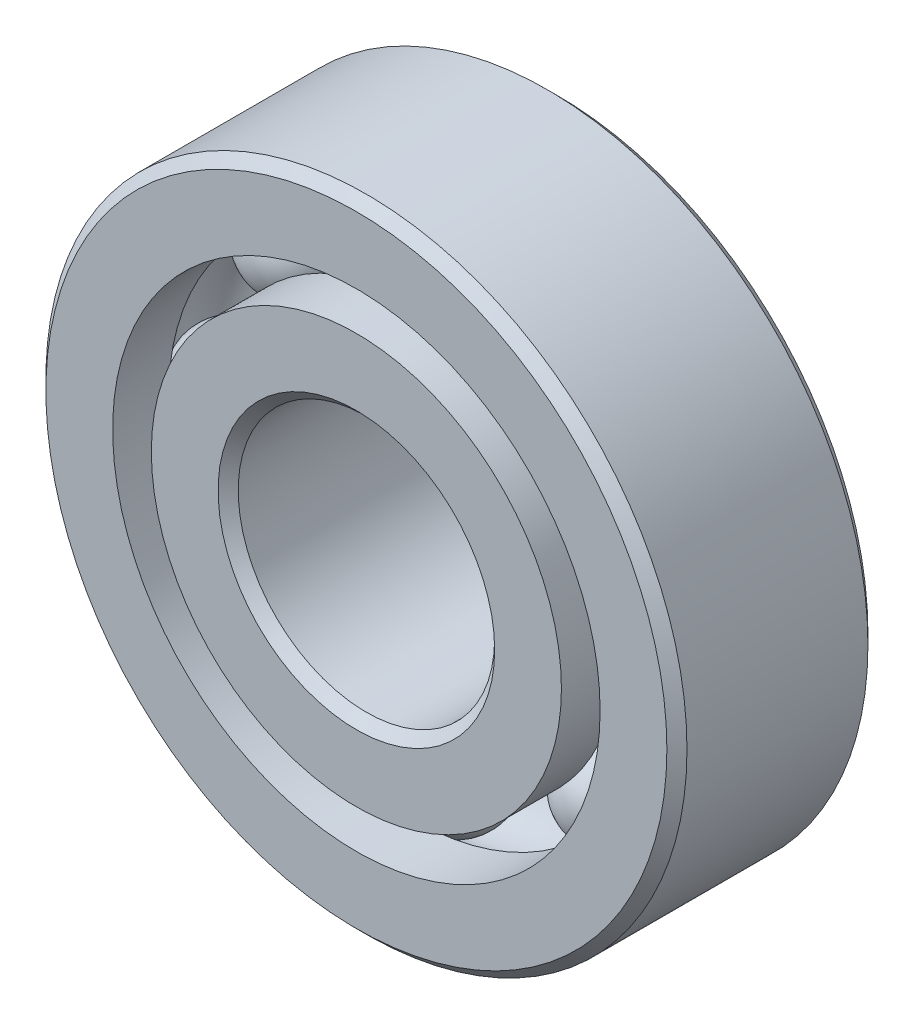
ISO-10303-21;
HEADER;
FILE_DESCRIPTION(('STEP AP214'),'2;1');
FILE_NAME('part.step','',(''),(''),'','','');
FILE_SCHEMA(('AUTOMOTIVE_DESIGN { 1 0 10303 214 1 1 1 1 }'));
ENDSEC;
DATA;
#1=APPLICATION_CONTEXT('core data for automotive mechanical design processes');
#2=APPLICATION_PROTOCOL_DEFINITION('international standard','automotive_design',2000,#1);
#3=PRODUCT_CONTEXT('',#1,'mechanical');
#4=PRODUCT('Part','Part','',(#3));
#5=PRODUCT_RELATED_PRODUCT_CATEGORY('part','',(#4));
#6=PRODUCT_DEFINITION_FORMATION('','',#4);
#7=PRODUCT_DEFINITION_CONTEXT('part definition',#1,'design');
#8=PRODUCT_DEFINITION('design','',#6,#7);
#9=PRODUCT_DEFINITION_SHAPE('','',#8);
#10=(LENGTH_UNIT() NAMED_UNIT(*) SI_UNIT(.MILLI.,.METRE.));
#11=(NAMED_UNIT(*) PLANE_ANGLE_UNIT() SI_UNIT($,.RADIAN.));
#12=(NAMED_UNIT(*) SI_UNIT($,.STERADIAN.) SOLID_ANGLE_UNIT());
#13=UNCERTAINTY_MEASURE_WITH_UNIT(LENGTH_MEASURE(1.E-05),#10,'distance_accuracy_value','');
#14=(GEOMETRIC_REPRESENTATION_CONTEXT(3) GLOBAL_UNCERTAINTY_ASSIGNED_CONTEXT((#13)) GLOBAL_UNIT_ASSIGNED_CONTEXT((#10,
#11,#12)) REPRESENTATION_CONTEXT('',''));
#15=CARTESIAN_POINT('',(0.,0.,0.));
#16=DIRECTION('',(0.,0.,1.));
#17=DIRECTION('',(1.,0.,0.));
#18=AXIS2_PLACEMENT_3D('',#15,#16,#17);
#19=CARTESIAN_POINT('',(-3.92886205296771,3.9288620529678,0.));
#20=DIRECTION('',(0.,0.,1.));
#21=DIRECTION('',(-0.707106781186539,0.707106781186556,0.));
#22=AXIS2_PLACEMENT_3D('',#19,#20,#21);
#23=SPHERICAL_SURFACE('',#22,1.20554465033679);
#24=CARTESIAN_POINT('',(-3.92886205296771,3.9288620529678,1.20554465033679));
#25=VERTEX_POINT('',#24);
#26=VERTEX_LOOP('',#25);
#27=FACE_BOUND('',#26,.T.);
#28=ADVANCED_FACE('F39',(#27),#23,.T.);
#29=CLOSED_SHELL('',(#28));
#30=MANIFOLD_SOLID_BREP('B2',#29);
#31=CARTESIAN_POINT('',(-5.55625,0.,0.));
#32=DIRECTION('',(0.,0.,1.));
#33=DIRECTION('',(-1.,0.,0.));
#34=AXIS2_PLACEMENT_3D('',#31,#32,#33);
#35=SPHERICAL_SURFACE('',#34,1.20554465033679);
#36=CARTESIAN_POINT('',(-5.55625,0.,1.20554465033679));
#37=VERTEX_POINT('',#36);
#38=VERTEX_LOOP('',#37);
#39=FACE_BOUND('',#38,.T.);
#40=ADVANCED_FACE('F59',(#39),#35,.T.);
#41=CLOSED_SHELL('',(#40));
#42=MANIFOLD_SOLID_BREP('B6',#41);
#43=CARTESIAN_POINT('',(-3.92886205296779,-3.92886205296772,0.));
#44=DIRECTION('',(0.,0.,1.));
#45=DIRECTION('',(-0.707106781186554,-0.707106781186541,0.));
#46=AXIS2_PLACEMENT_3D('',#43,#44,#45);
#47=SPHERICAL_SURFACE('',#46,1.20554465033679);
#48=CARTESIAN_POINT('',(-3.92886205296779,-3.92886205296772,1.20554465033679));
#49=VERTEX_POINT('',#48);
#50=VERTEX_LOOP('',#49);
#51=FACE_BOUND('',#50,.T.);
#52=ADVANCED_FACE('F79',(#51),#47,.T.);
#53=CLOSED_SHELL('',(#52));
#54=MANIFOLD_SOLID_BREP('B35',#53);
#55=CARTESIAN_POINT('',(0.,-5.55625,0.));
#56=DIRECTION('',(0.,0.,1.));
#57=DIRECTION('',(0.,-1.,0.));
#58=AXIS2_PLACEMENT_3D('',#55,#56,#57);
#59=SPHERICAL_SURFACE('',#58,1.20554465033679);
#60=CARTESIAN_POINT('',(0.,-5.55625,1.20554465033679));
#61=VERTEX_POINT('',#60);
#62=VERTEX_LOOP('',#61);
#63=FACE_BOUND('',#62,.T.);
#64=ADVANCED_FACE('F99',(#63),#59,.T.);
#65=CLOSED_SHELL('',(#64));
#66=MANIFOLD_SOLID_BREP('B55',#65);
#67=CARTESIAN_POINT('',(3.92886205296773,-3.92886205296777,0.));
#68=DIRECTION('',(0.,0.,1.));
#69=DIRECTION('',(0.707106781186544,-0.707106781186551,0.));
#70=AXIS2_PLACEMENT_3D('',#67,#68,#69);
#71=SPHERICAL_SURFACE('',#70,1.20554465033679);
#72=CARTESIAN_POINT('',(3.92886205296773,-3.92886205296777,1.20554465033679));
#73=VERTEX_POINT('',#72);
#74=VERTEX_LOOP('',#73);
#75=FACE_BOUND('',#74,.T.);
#76=ADVANCED_FACE('F119',(#75),#71,.T.);
#77=CLOSED_SHELL('',(#76));
#78=MANIFOLD_SOLID_BREP('B75',#77);
#79=CARTESIAN_POINT('',(5.55625,0.,0.));
#80=DIRECTION('',(0.,0.,1.));
#81=DIRECTION('',(1.,0.,0.));
#82=AXIS2_PLACEMENT_3D('',#79,#80,#81);
#83=SPHERICAL_SURFACE('',#82,1.20554465033679);
#84=CARTESIAN_POINT('',(5.55625,0.,1.20554465033679));
#85=VERTEX_POINT('',#84);
#86=VERTEX_LOOP('',#85);
#87=FACE_BOUND('',#86,.T.);
#88=ADVANCED_FACE('F139',(#87),#83,.T.);
#89=CLOSED_SHELL('',(#88));
#90=MANIFOLD_SOLID_BREP('B95',#89);
#91=CARTESIAN_POINT('',(3.92886205296776,3.92886205296775,0.));
#92=DIRECTION('',(0.,0.,1.));
#93=DIRECTION('',(0.707106781186549,0.707106781186546,0.));
#94=AXIS2_PLACEMENT_3D('',#91,#92,#93);
#95=SPHERICAL_SURFACE('',#94,1.20554465033679);
#96=CARTESIAN_POINT('',(3.92886205296776,3.92886205296775,1.20554465033679));
#97=VERTEX_POINT('',#96);
#98=VERTEX_LOOP('',#97);
#99=FACE_BOUND('',#98,.T.);
#100=ADVANCED_FACE('F159',(#99),#95,.T.);
#101=CLOSED_SHELL('',(#100));
#102=MANIFOLD_SOLID_BREP('B115',#101);
#103=CARTESIAN_POINT('',(0.,5.55625,0.));
#104=DIRECTION('',(0.,0.,1.));
#105=DIRECTION('',(0.,1.,0.));
#106=AXIS2_PLACEMENT_3D('',#103,#104,#105);
#107=SPHERICAL_SURFACE('',#106,1.20554465033679);
#108=CARTESIAN_POINT('',(0.,5.55625,1.20554465033679));
#109=VERTEX_POINT('',#108);
#110=VERTEX_LOOP('',#109);
#111=FACE_BOUND('',#110,.T.);
#112=ADVANCED_FACE('F181',(#111),#107,.T.);
#113=CLOSED_SHELL('',(#112));
#114=MANIFOLD_SOLID_BREP('B135',#113);
#115=CARTESIAN_POINT('',(0.,5.07727857142857,2.4892));
#116=DIRECTION('',(0.,0.,-1.));
#117=DIRECTION('',(-1.,0.,0.));
#118=AXIS2_PLACEMENT_3D('',#115,#116,#117);
#119=PLANE('',#118);
#120=CARTESIAN_POINT('',(0.,0.,2.4892));
#121=DIRECTION('',(0.,0.,1.));
#122=DIRECTION('',(1.,0.,0.));
#123=AXIS2_PLACEMENT_3D('',#120,#121,#122);
#124=CIRCLE('',#123,3.42392);
#125=CARTESIAN_POINT('',(3.42392,0.,2.4892));
#126=VERTEX_POINT('',#125);
#127=EDGE_CURVE('E228',#126,#126,#124,.T.);
#128=ORIENTED_EDGE('',*,*,#127,.F.);
#129=EDGE_LOOP('',(#128));
#130=FACE_BOUND('',#129,.T.);
#131=CARTESIAN_POINT('',(0.,0.,2.4892));
#132=DIRECTION('',(0.,0.,1.));
#133=DIRECTION('',(1.,0.,0.));
#134=AXIS2_PLACEMENT_3D('',#131,#132,#133);
#135=CIRCLE('',#134,5.07727857142857);
#136=CARTESIAN_POINT('',(5.07727857142857,0.,2.4892));
#137=VERTEX_POINT('',#136);
#138=EDGE_CURVE('E180',#137,#137,#135,.T.);
#139=ORIENTED_EDGE('',*,*,#138,.T.);
#140=EDGE_LOOP('',(#139));
#141=FACE_BOUND('',#140,.T.);
#142=ADVANCED_FACE('F200',(#130,#141),#119,.F.);
#143=CARTESIAN_POINT('',(0.,0.,2.4892));
#144=DIRECTION('',(0.,0.,1.));
#145=DIRECTION('',(1.,0.,0.));
#146=AXIS2_PLACEMENT_3D('',#143,#144,#145);
#147=CYLINDRICAL_SURFACE('',#146,5.07727857142857);
#148=ORIENTED_EDGE('',*,*,#138,.F.);
#149=EDGE_LOOP('',(#148));
#150=FACE_BOUND('',#149,.T.);
#151=CARTESIAN_POINT('',(0.,0.,1.10631111111111));
#152=DIRECTION('',(0.,0.,1.));
#153=DIRECTION('',(1.,0.,0.));
#154=AXIS2_PLACEMENT_3D('',#151,#152,#153);
#155=CIRCLE('',#154,5.07727857142857);
#156=CARTESIAN_POINT('',(5.07727857142857,0.,1.10631111111111));
#157=VERTEX_POINT('',#156);
#158=EDGE_CURVE('E206',#157,#157,#155,.T.);
#159=ORIENTED_EDGE('',*,*,#158,.T.);
#160=EDGE_LOOP('',(#159));
#161=FACE_BOUND('',#160,.T.);
#162=ADVANCED_FACE('F235',(#150,#161),#147,.T.);
#163=CARTESIAN_POINT('',(0.,0.,0.));
#164=DIRECTION('',(0.,0.,1.));
#165=DIRECTION('',(1.,0.,0.));
#166=AXIS2_PLACEMENT_3D('',#163,#164,#165);
#167=TOROIDAL_SURFACE('',#166,5.55625,1.20554465033679);
#168=ORIENTED_EDGE('',*,*,#158,.F.);
#169=EDGE_LOOP('',(#168));
#170=FACE_BOUND('',#169,.T.);
#171=CARTESIAN_POINT('',(0.,0.,-1.10631111111112));
#172=DIRECTION('',(0.,0.,1.));
#173=DIRECTION('',(1.,0.,0.));
#174=AXIS2_PLACEMENT_3D('',#171,#172,#173);
#175=CIRCLE('',#174,5.07727857142857);
#176=CARTESIAN_POINT('',(5.07727857142857,0.,-1.10631111111112));
#177=VERTEX_POINT('',#176);
#178=EDGE_CURVE('E210',#177,#177,#175,.T.);
#179=ORIENTED_EDGE('',*,*,#178,.T.);
#180=EDGE_LOOP('',(#179));
#181=FACE_BOUND('',#180,.T.);
#182=ADVANCED_FACE('F239',(#170,#181),#167,.F.);
#183=CARTESIAN_POINT('',(0.,0.,2.4892));
#184=DIRECTION('',(0.,0.,1.));
#185=DIRECTION('',(1.,0.,0.));
#186=AXIS2_PLACEMENT_3D('',#183,#184,#185);
#187=CYLINDRICAL_SURFACE('',#186,5.07727857142857);
#188=ORIENTED_EDGE('',*,*,#178,.F.);
#189=EDGE_LOOP('',(#188));
#190=FACE_BOUND('',#189,.T.);
#191=CARTESIAN_POINT('',(0.,0.,-2.4892));
#192=DIRECTION('',(0.,0.,1.));
#193=DIRECTION('',(1.,0.,0.));
#194=AXIS2_PLACEMENT_3D('',#191,#192,#193);
#195=CIRCLE('',#194,5.07727857142857);
#196=CARTESIAN_POINT('',(5.07727857142857,0.,-2.4892));
#197=VERTEX_POINT('',#196);
#198=EDGE_CURVE('E214',#197,#197,#195,.T.);
#199=ORIENTED_EDGE('',*,*,#198,.T.);
#200=EDGE_LOOP('',(#199));
#201=FACE_BOUND('',#200,.T.);
#202=ADVANCED_FACE('F244',(#190,#201),#187,.T.);
#203=CARTESIAN_POINT('',(0.,3.42392,-2.4892));
#204=DIRECTION('',(0.,0.,1.));
#205=DIRECTION('',(1.,0.,0.));
#206=AXIS2_PLACEMENT_3D('',#203,#204,#205);
#207=PLANE('',#206);
#208=ORIENTED_EDGE('',*,*,#198,.F.);
#209=EDGE_LOOP('',(#208));
#210=FACE_BOUND('',#209,.T.);
#211=CARTESIAN_POINT('',(0.,0.,-2.4892));
#212=DIRECTION('',(0.,0.,1.));
#213=DIRECTION('',(1.,0.,0.));
#214=AXIS2_PLACEMENT_3D('',#211,#212,#213);
#215=CIRCLE('',#214,3.42392);
#216=CARTESIAN_POINT('',(3.42392,0.,-2.4892));
#217=VERTEX_POINT('',#216);
#218=EDGE_CURVE('E219',#217,#217,#215,.T.);
#219=ORIENTED_EDGE('',*,*,#218,.T.);
#220=EDGE_LOOP('',(#219));
#221=FACE_BOUND('',#220,.T.);
#222=ADVANCED_FACE('F250',(#210,#221),#207,.F.);
#223=CARTESIAN_POINT('',(0.,0.,-2.24028));
#224=DIRECTION('',(0.,0.,-1.));
#225=DIRECTION('',(-1.,0.,0.));
#226=AXIS2_PLACEMENT_3D('',#223,#224,#225);
#227=CONICAL_SURFACE('',#226,3.175,0.785398163397453);
#228=ORIENTED_EDGE('',*,*,#218,.F.);
#229=EDGE_LOOP('',(#228));
#230=FACE_BOUND('',#229,.T.);
#231=CARTESIAN_POINT('',(0.,0.,-2.24028));
#232=DIRECTION('',(0.,0.,1.));
#233=DIRECTION('',(1.,0.,0.));
#234=AXIS2_PLACEMENT_3D('',#231,#232,#233);
#235=CIRCLE('',#234,3.175);
#236=CARTESIAN_POINT('',(3.175,0.,-2.24028));
#237=VERTEX_POINT('',#236);
#238=EDGE_CURVE('E222',#237,#237,#235,.T.);
#239=ORIENTED_EDGE('',*,*,#238,.T.);
#240=EDGE_LOOP('',(#239));
#241=FACE_BOUND('',#240,.T.);
#242=ADVANCED_FACE('F254',(#230,#241),#227,.F.);
#243=CARTESIAN_POINT('',(0.,0.,2.4892));
#244=DIRECTION('',(0.,0.,1.));
#245=DIRECTION('',(1.,0.,0.));
#246=AXIS2_PLACEMENT_3D('',#243,#244,#245);
#247=CYLINDRICAL_SURFACE('',#246,3.175);
#248=ORIENTED_EDGE('',*,*,#238,.F.);
#249=EDGE_LOOP('',(#248));
#250=FACE_BOUND('',#249,.T.);
#251=CARTESIAN_POINT('',(0.,0.,2.24028));
#252=DIRECTION('',(0.,0.,1.));
#253=DIRECTION('',(1.,0.,0.));
#254=AXIS2_PLACEMENT_3D('',#251,#252,#253);
#255=CIRCLE('',#254,3.175);
#256=CARTESIAN_POINT('',(3.175,0.,2.24028));
#257=VERTEX_POINT('',#256);
#258=EDGE_CURVE('E225',#257,#257,#255,.T.);
#259=ORIENTED_EDGE('',*,*,#258,.T.);
#260=EDGE_LOOP('',(#259));
#261=FACE_BOUND('',#260,.T.);
#262=ADVANCED_FACE('F258',(#250,#261),#247,.F.);
#263=CARTESIAN_POINT('',(0.,0.,2.4892));
#264=DIRECTION('',(0.,0.,1.));
#265=DIRECTION('',(1.,0.,0.));
#266=AXIS2_PLACEMENT_3D('',#263,#264,#265);
#267=CONICAL_SURFACE('',#266,3.42392,0.785398163397449);
#268=ORIENTED_EDGE('',*,*,#258,.F.);
#269=EDGE_LOOP('',(#268));
#270=FACE_BOUND('',#269,.T.);
#271=ORIENTED_EDGE('',*,*,#127,.T.);
#272=EDGE_LOOP('',(#271));
#273=FACE_BOUND('',#272,.T.);
#274=ADVANCED_FACE('F232',(#270,#273),#267,.F.);
#275=CLOSED_SHELL('',(#142,#162,#182,#202,#222,#242,#262,#274));
#276=MANIFOLD_SOLID_BREP('B155',#275);
#277=CARTESIAN_POINT('',(0.,0.,2.24028));
#278=DIRECTION('',(0.,0.,-1.));
#279=DIRECTION('',(-1.,0.,0.));
#280=AXIS2_PLACEMENT_3D('',#277,#278,#279);
#281=CONICAL_SURFACE('',#280,7.9375,0.785398163397446);
#282=CARTESIAN_POINT('',(0.,0.,2.4892));
#283=DIRECTION('',(0.,0.,1.));
#284=DIRECTION('',(1.,0.,0.));
#285=AXIS2_PLACEMENT_3D('',#282,#283,#284);
#286=CIRCLE('',#285,7.68858);
#287=CARTESIAN_POINT('',(7.68858,0.,2.4892));
#288=VERTEX_POINT('',#287);
#289=EDGE_CURVE('E349',#288,#288,#286,.T.);
#290=ORIENTED_EDGE('',*,*,#289,.F.);
#291=EDGE_LOOP('',(#290));
#292=FACE_BOUND('',#291,.T.);
#293=CARTESIAN_POINT('',(0.,0.,2.24028));
#294=DIRECTION('',(0.,0.,1.));
#295=DIRECTION('',(1.,0.,0.));
#296=AXIS2_PLACEMENT_3D('',#293,#294,#295);
#297=CIRCLE('',#296,7.9375);
#298=CARTESIAN_POINT('',(7.9375,0.,2.24028));
#299=VERTEX_POINT('',#298);
#300=EDGE_CURVE('E199',#299,#299,#297,.T.);
#301=ORIENTED_EDGE('',*,*,#300,.T.);
#302=EDGE_LOOP('',(#301));
#303=FACE_BOUND('',#302,.T.);
#304=ADVANCED_FACE('F321',(#292,#303),#281,.T.);
#305=CARTESIAN_POINT('',(0.,0.,2.4892));
#306=DIRECTION('',(0.,0.,1.));
#307=DIRECTION('',(1.,0.,0.));
#308=AXIS2_PLACEMENT_3D('',#305,#306,#307);
#309=CYLINDRICAL_SURFACE('',#308,7.9375);
#310=ORIENTED_EDGE('',*,*,#300,.F.);
#311=EDGE_LOOP('',(#310));
#312=FACE_BOUND('',#311,.T.);
#313=CARTESIAN_POINT('',(0.,0.,-2.24028));
#314=DIRECTION('',(0.,0.,1.));
#315=DIRECTION('',(1.,0.,0.));
#316=AXIS2_PLACEMENT_3D('',#313,#314,#315);
#317=CIRCLE('',#316,7.9375);
#318=CARTESIAN_POINT('',(7.9375,0.,-2.24028));
#319=VERTEX_POINT('',#318);
#320=EDGE_CURVE('E327',#319,#319,#317,.T.);
#321=ORIENTED_EDGE('',*,*,#320,.T.);
#322=EDGE_LOOP('',(#321));
#323=FACE_BOUND('',#322,.T.);
#324=ADVANCED_FACE('F356',(#312,#323),#309,.T.);
#325=CARTESIAN_POINT('',(0.,0.,-2.4892));
#326=DIRECTION('',(0.,0.,1.));
#327=DIRECTION('',(1.,0.,0.));
#328=AXIS2_PLACEMENT_3D('',#325,#326,#327);
#329=CONICAL_SURFACE('',#328,7.68858,0.785398163397445);
#330=ORIENTED_EDGE('',*,*,#320,.F.);
#331=EDGE_LOOP('',(#330));
#332=FACE_BOUND('',#331,.T.);
#333=CARTESIAN_POINT('',(0.,0.,-2.4892));
#334=DIRECTION('',(0.,0.,1.));
#335=DIRECTION('',(1.,0.,0.));
#336=AXIS2_PLACEMENT_3D('',#333,#334,#335);
#337=CIRCLE('',#336,7.68858);
#338=CARTESIAN_POINT('',(7.68858,0.,-2.4892));
#339=VERTEX_POINT('',#338);
#340=EDGE_CURVE('E331',#339,#339,#337,.T.);
#341=ORIENTED_EDGE('',*,*,#340,.T.);
#342=EDGE_LOOP('',(#341));
#343=FACE_BOUND('',#342,.T.);
#344=ADVANCED_FACE('F360',(#332,#343),#329,.T.);
#345=CARTESIAN_POINT('',(0.,7.68858,-2.4892));
#346=DIRECTION('',(0.,0.,1.));
#347=DIRECTION('',(1.,0.,0.));
#348=AXIS2_PLACEMENT_3D('',#345,#346,#347);
#349=PLANE('',#348);
#350=ORIENTED_EDGE('',*,*,#340,.F.);
#351=EDGE_LOOP('',(#350));
#352=FACE_BOUND('',#351,.T.);
#353=CARTESIAN_POINT('',(0.,0.,-2.4892));
#354=DIRECTION('',(0.,0.,1.));
#355=DIRECTION('',(1.,0.,0.));
#356=AXIS2_PLACEMENT_3D('',#353,#354,#355);
#357=CIRCLE('',#356,6.03522142857143);
#358=CARTESIAN_POINT('',(6.03522142857143,0.,-2.4892));
#359=VERTEX_POINT('',#358);
#360=EDGE_CURVE('E335',#359,#359,#357,.T.);
#361=ORIENTED_EDGE('',*,*,#360,.T.);
#362=EDGE_LOOP('',(#361));
#363=FACE_BOUND('',#362,.T.);
#364=ADVANCED_FACE('F365',(#352,#363),#349,.F.);
#365=CARTESIAN_POINT('',(0.,0.,2.4892));
#366=DIRECTION('',(0.,0.,1.));
#367=DIRECTION('',(1.,0.,0.));
#368=AXIS2_PLACEMENT_3D('',#365,#366,#367);
#369=CYLINDRICAL_SURFACE('',#368,6.03522142857143);
#370=ORIENTED_EDGE('',*,*,#360,.F.);
#371=EDGE_LOOP('',(#370));
#372=FACE_BOUND('',#371,.T.);
#373=CARTESIAN_POINT('',(0.,0.,-1.10631111111111));
#374=DIRECTION('',(0.,0.,1.));
#375=DIRECTION('',(1.,0.,0.));
#376=AXIS2_PLACEMENT_3D('',#373,#374,#375);
#377=CIRCLE('',#376,6.03522142857143);
#378=CARTESIAN_POINT('',(6.03522142857143,0.,-1.10631111111111));
#379=VERTEX_POINT('',#378);
#380=EDGE_CURVE('E340',#379,#379,#377,.T.);
#381=ORIENTED_EDGE('',*,*,#380,.T.);
#382=EDGE_LOOP('',(#381));
#383=FACE_BOUND('',#382,.T.);
#384=ADVANCED_FACE('F371',(#372,#383),#369,.F.);
#385=CARTESIAN_POINT('',(0.,0.,0.));
#386=DIRECTION('',(0.,0.,1.));
#387=DIRECTION('',(1.,0.,0.));
#388=AXIS2_PLACEMENT_3D('',#385,#386,#387);
#389=TOROIDAL_SURFACE('',#388,5.55625,1.20554465033679);
#390=ORIENTED_EDGE('',*,*,#380,.F.);
#391=EDGE_LOOP('',(#390));
#392=FACE_BOUND('',#391,.T.);
#393=CARTESIAN_POINT('',(0.,0.,1.10631111111111));
#394=DIRECTION('',(0.,0.,1.));
#395=DIRECTION('',(1.,0.,0.));
#396=AXIS2_PLACEMENT_3D('',#393,#394,#395);
#397=CIRCLE('',#396,6.03522142857143);
#398=CARTESIAN_POINT('',(6.03522142857143,0.,1.10631111111111));
#399=VERTEX_POINT('',#398);
#400=EDGE_CURVE('E343',#399,#399,#397,.T.);
#401=ORIENTED_EDGE('',*,*,#400,.T.);
#402=EDGE_LOOP('',(#401));
#403=FACE_BOUND('',#402,.T.);
#404=ADVANCED_FACE('F375',(#392,#403),#389,.F.);
#405=CARTESIAN_POINT('',(0.,0.,2.4892));
#406=DIRECTION('',(0.,0.,1.));
#407=DIRECTION('',(1.,0.,0.));
#408=AXIS2_PLACEMENT_3D('',#405,#406,#407);
#409=CYLINDRICAL_SURFACE('',#408,6.03522142857143);
#410=ORIENTED_EDGE('',*,*,#400,.F.);
#411=EDGE_LOOP('',(#410));
#412=FACE_BOUND('',#411,.T.);
#413=CARTESIAN_POINT('',(0.,0.,2.4892));
#414=DIRECTION('',(0.,0.,1.));
#415=DIRECTION('',(1.,0.,0.));
#416=AXIS2_PLACEMENT_3D('',#413,#414,#415);
#417=CIRCLE('',#416,6.03522142857143);
#418=CARTESIAN_POINT('',(6.03522142857143,0.,2.4892));
#419=VERTEX_POINT('',#418);
#420=EDGE_CURVE('E346',#419,#419,#417,.T.);
#421=ORIENTED_EDGE('',*,*,#420,.T.);
#422=EDGE_LOOP('',(#421));
#423=FACE_BOUND('',#422,.T.);
#424=ADVANCED_FACE('F379',(#412,#423),#409,.F.);
#425=CARTESIAN_POINT('',(0.,7.68858,2.4892));
#426=DIRECTION('',(0.,0.,-1.));
#427=DIRECTION('',(-1.,0.,0.));
#428=AXIS2_PLACEMENT_3D('',#425,#426,#427);
#429=PLANE('',#428);
#430=ORIENTED_EDGE('',*,*,#420,.F.);
#431=EDGE_LOOP('',(#430));
#432=FACE_BOUND('',#431,.T.);
#433=ORIENTED_EDGE('',*,*,#289,.T.);
#434=EDGE_LOOP('',(#433));
#435=FACE_BOUND('',#434,.T.);
#436=ADVANCED_FACE('F353',(#432,#435),#429,.F.);
#437=CLOSED_SHELL('',(#304,#324,#344,#364,#384,#404,#424,#436));
#438=MANIFOLD_SOLID_BREP('B175',#437);
#439=ADVANCED_BREP_SHAPE_REPRESENTATION('',(#18,#30,#42,#54,#66,#78,#90,#102,#114,#276,#438),#14);
#440=SHAPE_DEFINITION_REPRESENTATION(#9,#439);
ENDSEC;
END-ISO-10303-21;
